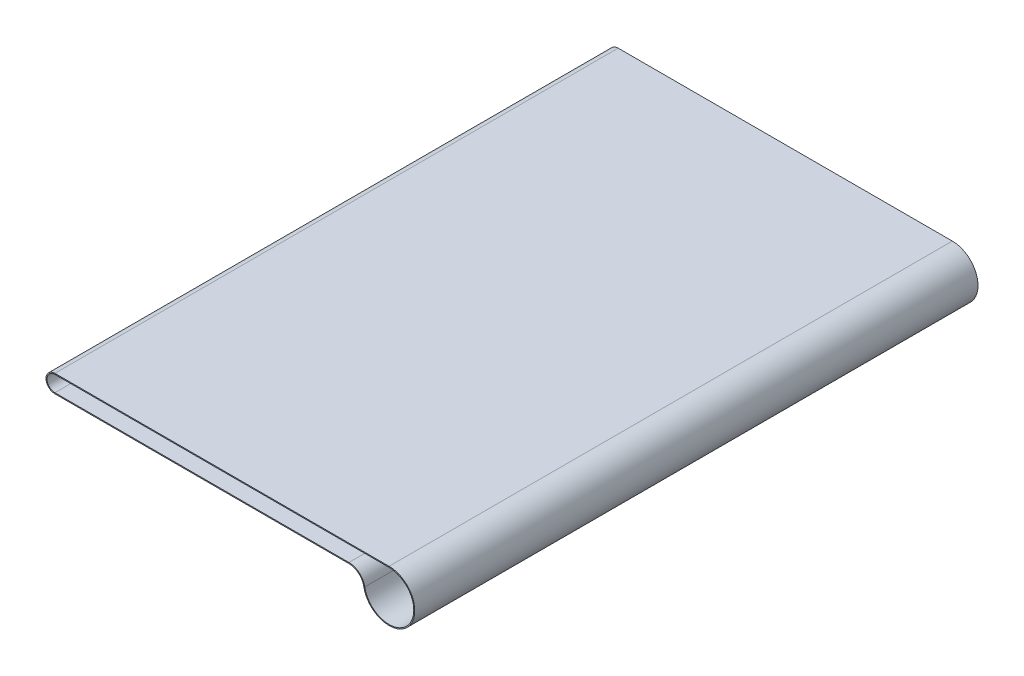
ISO-10303-21;
HEADER;
FILE_DESCRIPTION(('STEP AP214'),'2;1');
FILE_NAME('part.step','',(''),(''),'','','');
FILE_SCHEMA(('AUTOMOTIVE_DESIGN { 1 0 10303 214 1 1 1 1 }'));
ENDSEC;
DATA;
#1=APPLICATION_CONTEXT('core data for automotive mechanical design processes');
#2=APPLICATION_PROTOCOL_DEFINITION('international standard','automotive_design',2000,#1);
#3=PRODUCT_CONTEXT('',#1,'mechanical');
#4=PRODUCT('Part','Part','',(#3));
#5=PRODUCT_RELATED_PRODUCT_CATEGORY('part','',(#4));
#6=PRODUCT_DEFINITION_FORMATION('','',#4);
#7=PRODUCT_DEFINITION_CONTEXT('part definition',#1,'design');
#8=PRODUCT_DEFINITION('design','',#6,#7);
#9=PRODUCT_DEFINITION_SHAPE('','',#8);
#10=(LENGTH_UNIT() NAMED_UNIT(*) SI_UNIT(.MILLI.,.METRE.));
#11=(NAMED_UNIT(*) PLANE_ANGLE_UNIT() SI_UNIT($,.RADIAN.));
#12=(NAMED_UNIT(*) SI_UNIT($,.STERADIAN.) SOLID_ANGLE_UNIT());
#13=UNCERTAINTY_MEASURE_WITH_UNIT(LENGTH_MEASURE(1.E-05),#10,'distance_accuracy_value','');
#14=(GEOMETRIC_REPRESENTATION_CONTEXT(3) GLOBAL_UNCERTAINTY_ASSIGNED_CONTEXT((#13)) GLOBAL_UNIT_ASSIGNED_CONTEXT((#10,
#11,#12)) REPRESENTATION_CONTEXT('',''));
#15=CARTESIAN_POINT('',(0.,0.,0.));
#16=DIRECTION('',(0.,0.,1.));
#17=DIRECTION('',(1.,0.,0.));
#18=AXIS2_PLACEMENT_3D('',#15,#16,#17);
#19=CARTESIAN_POINT('',(285.123660002502,-32.2935750323031,570.));
#20=DIRECTION('',(0.,0.,1.));
#21=DIRECTION('',(1.,0.,0.));
#22=AXIS2_PLACEMENT_3D('',#19,#20,#21);
#23=PLANE('',#22);
#24=CARTESIAN_POINT('',(285.123660002502,-32.2935750323031,570.));
#25=DIRECTION('',(0.,0.,-1.));
#26=DIRECTION('',(1.,0.,0.));
#27=AXIS2_PLACEMENT_3D('',#24,#25,#26);
#28=CIRCLE('',#27,15.2935750323031);
#29=CARTESIAN_POINT('',(285.123660002502,-17.,570.));
#30=VERTEX_POINT('',#29);
#31=CARTESIAN_POINT('',(300.17678630454,-29.5923112903529,570.));
#32=VERTEX_POINT('',#31);
#33=EDGE_CURVE('E156',#30,#32,#28,.T.);
#34=ORIENTED_EDGE('',*,*,#33,.T.);
#35=CARTESIAN_POINT('',(325.768008960218,-25.,570.));
#36=DIRECTION('',(0.,0.,1.));
#37=DIRECTION('',(1.,0.,0.));
#38=AXIS2_PLACEMENT_3D('',#35,#36,#37);
#39=CIRCLE('',#38,26.);
#40=CARTESIAN_POINT('',(325.768008960218,0.999999999999997,570.));
#41=VERTEX_POINT('',#40);
#42=EDGE_CURVE('E159',#32,#41,#39,.T.);
#43=ORIENTED_EDGE('',*,*,#42,.T.);
#44=DIRECTION('',(-1.,0.,0.));
#45=VECTOR('',#44,1.);
#46=CARTESIAN_POINT('',(-12.4049645311594,0.999999999999999,570.));
#47=LINE('',#46,#45);
#48=CARTESIAN_POINT('',(-12.4049645311594,0.999999999999999,570.));
#49=VERTEX_POINT('',#48);
#50=EDGE_CURVE('E162',#41,#49,#47,.T.);
#51=ORIENTED_EDGE('',*,*,#50,.T.);
#52=CARTESIAN_POINT('',(-12.4049645311594,-8.,570.));
#53=DIRECTION('',(0.,0.,1.));
#54=DIRECTION('',(1.,0.,0.));
#55=AXIS2_PLACEMENT_3D('',#52,#53,#54);
#56=CIRCLE('',#55,9.);
#57=CARTESIAN_POINT('',(-12.4049645311594,-17.,570.));
#58=VERTEX_POINT('',#57);
#59=EDGE_CURVE('E164',#49,#58,#56,.T.);
#60=ORIENTED_EDGE('',*,*,#59,.T.);
#61=DIRECTION('',(1.,0.,0.));
#62=VECTOR('',#61,1.);
#63=CARTESIAN_POINT('',(-12.4049645311594,-17.,570.));
#64=LINE('',#63,#62);
#65=EDGE_CURVE('E166',#58,#30,#64,.T.);
#66=ORIENTED_EDGE('',*,*,#65,.T.);
#67=EDGE_LOOP('',(#34,#43,#51,#60,#66));
#68=FACE_BOUND('',#67,.T.);
#69=CARTESIAN_POINT('',(325.768008960218,-25.,570.));
#70=DIRECTION('',(0.,0.,1.));
#71=DIRECTION('',(1.,0.,0.));
#72=AXIS2_PLACEMENT_3D('',#69,#70,#71);
#73=CIRCLE('',#72,25.);
#74=CARTESIAN_POINT('',(301.161064098989,-29.4156839330317,570.));
#75=VERTEX_POINT('',#74);
#76=CARTESIAN_POINT('',(325.768008960218,0.,570.));
#77=VERTEX_POINT('',#76);
#78=EDGE_CURVE('E120',#75,#77,#73,.T.);
#79=ORIENTED_EDGE('',*,*,#78,.F.);
#80=CARTESIAN_POINT('',(285.123660002502,-32.2935750323031,570.));
#81=DIRECTION('',(0.,0.,-1.));
#82=DIRECTION('',(1.,0.,0.));
#83=AXIS2_PLACEMENT_3D('',#80,#81,#82);
#84=CIRCLE('',#83,16.2935750323031);
#85=CARTESIAN_POINT('',(285.123660002502,-16.,570.));
#86=VERTEX_POINT('',#85);
#87=EDGE_CURVE('E112',#86,#75,#84,.T.);
#88=ORIENTED_EDGE('',*,*,#87,.F.);
#89=DIRECTION('',(1.,0.,0.));
#90=VECTOR('',#89,1.);
#91=CARTESIAN_POINT('',(-12.4049645311594,-16.,570.));
#92=LINE('',#91,#90);
#93=CARTESIAN_POINT('',(-12.4049645311594,-16.,570.));
#94=VERTEX_POINT('',#93);
#95=EDGE_CURVE('E139',#94,#86,#92,.T.);
#96=ORIENTED_EDGE('',*,*,#95,.F.);
#97=CARTESIAN_POINT('',(-12.4049645311594,-8.,570.));
#98=DIRECTION('',(0.,0.,1.));
#99=DIRECTION('',(1.,0.,0.));
#100=AXIS2_PLACEMENT_3D('',#97,#98,#99);
#101=CIRCLE('',#100,8.);
#102=CARTESIAN_POINT('',(-12.4049645311594,0.,570.));
#103=VERTEX_POINT('',#102);
#104=EDGE_CURVE('E135',#103,#94,#101,.T.);
#105=ORIENTED_EDGE('',*,*,#104,.F.);
#106=DIRECTION('',(-1.,0.,0.));
#107=VECTOR('',#106,1.);
#108=CARTESIAN_POINT('',(-12.4049645311594,0.,570.));
#109=LINE('',#108,#107);
#110=EDGE_CURVE('E133',#77,#103,#109,.T.);
#111=ORIENTED_EDGE('',*,*,#110,.F.);
#112=EDGE_LOOP('',(#79,#88,#96,#105,#111));
#113=FACE_BOUND('',#112,.T.);
#114=ADVANCED_FACE('F35',(#68,#113),#23,.T.);
#115=CARTESIAN_POINT('',(285.123660002502,-32.2935750323031,0.));
#116=DIRECTION('',(0.,0.,1.));
#117=DIRECTION('',(1.,0.,0.));
#118=AXIS2_PLACEMENT_3D('',#115,#116,#117);
#119=PLANE('',#118);
#120=CARTESIAN_POINT('',(285.123660002502,-32.2935750323031,0.));
#121=DIRECTION('',(0.,0.,-1.));
#122=DIRECTION('',(1.,0.,0.));
#123=AXIS2_PLACEMENT_3D('',#120,#121,#122);
#124=CIRCLE('',#123,15.2935750323031);
#125=CARTESIAN_POINT('',(285.123660002502,-17.,0.));
#126=VERTEX_POINT('',#125);
#127=CARTESIAN_POINT('',(300.17678630454,-29.5923112903529,0.));
#128=VERTEX_POINT('',#127);
#129=EDGE_CURVE('E128',#126,#128,#124,.T.);
#130=ORIENTED_EDGE('',*,*,#129,.F.);
#131=DIRECTION('',(1.,0.,0.));
#132=VECTOR('',#131,1.);
#133=CARTESIAN_POINT('',(-12.4049645311594,-17.,0.));
#134=LINE('',#133,#132);
#135=CARTESIAN_POINT('',(-12.4049645311594,-17.,0.));
#136=VERTEX_POINT('',#135);
#137=EDGE_CURVE('E160',#136,#126,#134,.T.);
#138=ORIENTED_EDGE('',*,*,#137,.F.);
#139=CARTESIAN_POINT('',(-12.4049645311594,-8.,0.));
#140=DIRECTION('',(0.,0.,1.));
#141=DIRECTION('',(1.,0.,0.));
#142=AXIS2_PLACEMENT_3D('',#139,#140,#141);
#143=CIRCLE('',#142,9.);
#144=CARTESIAN_POINT('',(-12.4049645311594,0.999999999999999,0.));
#145=VERTEX_POINT('',#144);
#146=EDGE_CURVE('E175',#145,#136,#143,.T.);
#147=ORIENTED_EDGE('',*,*,#146,.F.);
#148=DIRECTION('',(-1.,0.,0.));
#149=VECTOR('',#148,1.);
#150=CARTESIAN_POINT('',(-12.4049645311594,0.999999999999999,0.));
#151=LINE('',#150,#149);
#152=CARTESIAN_POINT('',(325.768008960218,0.999999999999997,0.));
#153=VERTEX_POINT('',#152);
#154=EDGE_CURVE('E173',#153,#145,#151,.T.);
#155=ORIENTED_EDGE('',*,*,#154,.F.);
#156=CARTESIAN_POINT('',(325.768008960218,-25.,0.));
#157=DIRECTION('',(0.,0.,1.));
#158=DIRECTION('',(1.,0.,0.));
#159=AXIS2_PLACEMENT_3D('',#156,#157,#158);
#160=CIRCLE('',#159,26.);
#161=EDGE_CURVE('E171',#128,#153,#160,.T.);
#162=ORIENTED_EDGE('',*,*,#161,.F.);
#163=EDGE_LOOP('',(#130,#138,#147,#155,#162));
#164=FACE_BOUND('',#163,.T.);
#165=CARTESIAN_POINT('',(285.123660002502,-32.2935750323031,0.));
#166=DIRECTION('',(0.,0.,-1.));
#167=DIRECTION('',(1.,0.,0.));
#168=AXIS2_PLACEMENT_3D('',#165,#166,#167);
#169=CIRCLE('',#168,16.2935750323031);
#170=CARTESIAN_POINT('',(285.123660002502,-16.,0.));
#171=VERTEX_POINT('',#170);
#172=CARTESIAN_POINT('',(301.161064098989,-29.4156839330317,0.));
#173=VERTEX_POINT('',#172);
#174=EDGE_CURVE('E58',#171,#173,#169,.T.);
#175=ORIENTED_EDGE('',*,*,#174,.T.);
#176=CARTESIAN_POINT('',(325.768008960218,-25.,0.));
#177=DIRECTION('',(0.,0.,1.));
#178=DIRECTION('',(1.,0.,0.));
#179=AXIS2_PLACEMENT_3D('',#176,#177,#178);
#180=CIRCLE('',#179,25.);
#181=CARTESIAN_POINT('',(325.768008960218,0.,0.));
#182=VERTEX_POINT('',#181);
#183=EDGE_CURVE('E127',#173,#182,#180,.T.);
#184=ORIENTED_EDGE('',*,*,#183,.T.);
#185=DIRECTION('',(-1.,0.,0.));
#186=VECTOR('',#185,1.);
#187=CARTESIAN_POINT('',(-12.4049645311594,0.,0.));
#188=LINE('',#187,#186);
#189=CARTESIAN_POINT('',(-12.4049645311594,0.,0.));
#190=VERTEX_POINT('',#189);
#191=EDGE_CURVE('E143',#182,#190,#188,.T.);
#192=ORIENTED_EDGE('',*,*,#191,.T.);
#193=CARTESIAN_POINT('',(-12.4049645311594,-8.,0.));
#194=DIRECTION('',(0.,0.,1.));
#195=DIRECTION('',(1.,0.,0.));
#196=AXIS2_PLACEMENT_3D('',#193,#194,#195);
#197=CIRCLE('',#196,8.);
#198=CARTESIAN_POINT('',(-12.4049645311594,-16.,0.));
#199=VERTEX_POINT('',#198);
#200=EDGE_CURVE('E146',#190,#199,#197,.T.);
#201=ORIENTED_EDGE('',*,*,#200,.T.);
#202=DIRECTION('',(1.,0.,0.));
#203=VECTOR('',#202,1.);
#204=CARTESIAN_POINT('',(-12.4049645311594,-16.,0.));
#205=LINE('',#204,#203);
#206=EDGE_CURVE('E121',#199,#171,#205,.T.);
#207=ORIENTED_EDGE('',*,*,#206,.T.);
#208=EDGE_LOOP('',(#175,#184,#192,#201,#207));
#209=FACE_BOUND('',#208,.T.);
#210=ADVANCED_FACE('F196',(#164,#209),#119,.F.);
#211=CARTESIAN_POINT('',(285.123660002502,-32.2935750323031,570.));
#212=DIRECTION('',(0.,0.,-1.));
#213=DIRECTION('',(-1.,0.,0.));
#214=AXIS2_PLACEMENT_3D('',#211,#212,#213);
#215=CYLINDRICAL_SURFACE('',#214,15.2935750323031);
#216=ORIENTED_EDGE('',*,*,#129,.T.);
#217=DIRECTION('',(0.,0.,-1.));
#218=VECTOR('',#217,1.);
#219=CARTESIAN_POINT('',(300.17678630454,-29.5923112903529,570.));
#220=LINE('',#219,#218);
#221=EDGE_CURVE('E11',#32,#128,#220,.T.);
#222=ORIENTED_EDGE('',*,*,#221,.F.);
#223=ORIENTED_EDGE('',*,*,#33,.F.);
#224=DIRECTION('',(0.,0.,-1.));
#225=VECTOR('',#224,1.);
#226=CARTESIAN_POINT('',(285.123660002502,-17.,570.));
#227=LINE('',#226,#225);
#228=EDGE_CURVE('E168',#30,#126,#227,.T.);
#229=ORIENTED_EDGE('',*,*,#228,.T.);
#230=EDGE_LOOP('',(#216,#222,#223,#229));
#231=FACE_BOUND('',#230,.T.);
#232=ADVANCED_FACE('F37',(#231),#215,.F.);
#233=CARTESIAN_POINT('',(325.768008960218,-25.,570.));
#234=DIRECTION('',(0.,0.,-1.));
#235=DIRECTION('',(-1.,0.,0.));
#236=AXIS2_PLACEMENT_3D('',#233,#234,#235);
#237=CYLINDRICAL_SURFACE('',#236,26.);
#238=ORIENTED_EDGE('',*,*,#161,.T.);
#239=DIRECTION('',(0.,0.,-1.));
#240=VECTOR('',#239,1.);
#241=CARTESIAN_POINT('',(325.768008960218,0.999999999999997,570.));
#242=LINE('',#241,#240);
#243=EDGE_CURVE('E43',#41,#153,#242,.T.);
#244=ORIENTED_EDGE('',*,*,#243,.F.);
#245=ORIENTED_EDGE('',*,*,#42,.F.);
#246=ORIENTED_EDGE('',*,*,#221,.T.);
#247=EDGE_LOOP('',(#238,#244,#245,#246));
#248=FACE_BOUND('',#247,.T.);
#249=ADVANCED_FACE('F210',(#248),#237,.T.);
#250=CARTESIAN_POINT('',(-12.4049645311594,0.999999999999999,570.));
#251=DIRECTION('',(0.,-1.,0.));
#252=DIRECTION('',(1.,0.,0.));
#253=AXIS2_PLACEMENT_3D('',#250,#251,#252);
#254=PLANE('',#253);
#255=ORIENTED_EDGE('',*,*,#154,.T.);
#256=DIRECTION('',(0.,0.,-1.));
#257=VECTOR('',#256,1.);
#258=CARTESIAN_POINT('',(-12.4049645311594,0.999999999999999,570.));
#259=LINE('',#258,#257);
#260=EDGE_CURVE('E183',#49,#145,#259,.T.);
#261=ORIENTED_EDGE('',*,*,#260,.F.);
#262=ORIENTED_EDGE('',*,*,#50,.F.);
#263=ORIENTED_EDGE('',*,*,#243,.T.);
#264=EDGE_LOOP('',(#255,#261,#262,#263));
#265=FACE_BOUND('',#264,.T.);
#266=ADVANCED_FACE('F190',(#265),#254,.F.);
#267=CARTESIAN_POINT('',(-12.4049645311594,-8.,570.));
#268=DIRECTION('',(0.,0.,-1.));
#269=DIRECTION('',(-1.,0.,0.));
#270=AXIS2_PLACEMENT_3D('',#267,#268,#269);
#271=CYLINDRICAL_SURFACE('',#270,9.);
#272=ORIENTED_EDGE('',*,*,#146,.T.);
#273=DIRECTION('',(0.,0.,-1.));
#274=VECTOR('',#273,1.);
#275=CARTESIAN_POINT('',(-12.4049645311594,-17.,570.));
#276=LINE('',#275,#274);
#277=EDGE_CURVE('E180',#58,#136,#276,.T.);
#278=ORIENTED_EDGE('',*,*,#277,.F.);
#279=ORIENTED_EDGE('',*,*,#59,.F.);
#280=ORIENTED_EDGE('',*,*,#260,.T.);
#281=EDGE_LOOP('',(#272,#278,#279,#280));
#282=FACE_BOUND('',#281,.T.);
#283=ADVANCED_FACE('F201',(#282),#271,.T.);
#284=CARTESIAN_POINT('',(-12.4049645311594,-17.,570.));
#285=DIRECTION('',(0.,1.,0.));
#286=DIRECTION('',(0.,0.,1.));
#287=AXIS2_PLACEMENT_3D('',#284,#285,#286);
#288=PLANE('',#287);
#289=ORIENTED_EDGE('',*,*,#137,.T.);
#290=ORIENTED_EDGE('',*,*,#228,.F.);
#291=ORIENTED_EDGE('',*,*,#65,.F.);
#292=ORIENTED_EDGE('',*,*,#277,.T.);
#293=EDGE_LOOP('',(#289,#290,#291,#292));
#294=FACE_BOUND('',#293,.T.);
#295=ADVANCED_FACE('F205',(#294),#288,.F.);
#296=CARTESIAN_POINT('',(285.123660002502,-32.2935750323031,570.));
#297=DIRECTION('',(0.,0.,-1.));
#298=DIRECTION('',(-1.,0.,0.));
#299=AXIS2_PLACEMENT_3D('',#296,#297,#298);
#300=CYLINDRICAL_SURFACE('',#299,16.2935750323031);
#301=ORIENTED_EDGE('',*,*,#174,.F.);
#302=DIRECTION('',(0.,0.,-1.));
#303=VECTOR('',#302,1.);
#304=CARTESIAN_POINT('',(285.123660002502,-16.,570.));
#305=LINE('',#304,#303);
#306=EDGE_CURVE('E116',#86,#171,#305,.T.);
#307=ORIENTED_EDGE('',*,*,#306,.F.);
#308=ORIENTED_EDGE('',*,*,#87,.T.);
#309=DIRECTION('',(0.,0.,-1.));
#310=VECTOR('',#309,1.);
#311=CARTESIAN_POINT('',(301.161064098989,-29.4156839330317,570.));
#312=LINE('',#311,#310);
#313=EDGE_CURVE('E115',#75,#173,#312,.T.);
#314=ORIENTED_EDGE('',*,*,#313,.T.);
#315=EDGE_LOOP('',(#301,#307,#308,#314));
#316=FACE_BOUND('',#315,.T.);
#317=ADVANCED_FACE('F114',(#316),#300,.T.);
#318=CARTESIAN_POINT('',(325.768008960218,-25.,570.));
#319=DIRECTION('',(0.,0.,-1.));
#320=DIRECTION('',(-1.,0.,0.));
#321=AXIS2_PLACEMENT_3D('',#318,#319,#320);
#322=CYLINDRICAL_SURFACE('',#321,25.);
#323=ORIENTED_EDGE('',*,*,#183,.F.);
#324=ORIENTED_EDGE('',*,*,#313,.F.);
#325=ORIENTED_EDGE('',*,*,#78,.T.);
#326=DIRECTION('',(0.,0.,-1.));
#327=VECTOR('',#326,1.);
#328=CARTESIAN_POINT('',(325.768008960218,0.,570.));
#329=LINE('',#328,#327);
#330=EDGE_CURVE('E129',#77,#182,#329,.T.);
#331=ORIENTED_EDGE('',*,*,#330,.T.);
#332=EDGE_LOOP('',(#323,#324,#325,#331));
#333=FACE_BOUND('',#332,.T.);
#334=ADVANCED_FACE('F124',(#333),#322,.F.);
#335=CARTESIAN_POINT('',(-12.4049645311594,0.,570.));
#336=DIRECTION('',(0.,-1.,0.));
#337=DIRECTION('',(0.,0.,-1.));
#338=AXIS2_PLACEMENT_3D('',#335,#336,#337);
#339=PLANE('',#338);
#340=ORIENTED_EDGE('',*,*,#191,.F.);
#341=ORIENTED_EDGE('',*,*,#330,.F.);
#342=ORIENTED_EDGE('',*,*,#110,.T.);
#343=DIRECTION('',(0.,0.,-1.));
#344=VECTOR('',#343,1.);
#345=CARTESIAN_POINT('',(-12.4049645311594,0.,570.));
#346=LINE('',#345,#344);
#347=EDGE_CURVE('E153',#103,#190,#346,.T.);
#348=ORIENTED_EDGE('',*,*,#347,.T.);
#349=EDGE_LOOP('',(#340,#341,#342,#348));
#350=FACE_BOUND('',#349,.T.);
#351=ADVANCED_FACE('F253',(#350),#339,.T.);
#352=CARTESIAN_POINT('',(-12.4049645311594,-8.,570.));
#353=DIRECTION('',(0.,0.,-1.));
#354=DIRECTION('',(-1.,0.,0.));
#355=AXIS2_PLACEMENT_3D('',#352,#353,#354);
#356=CYLINDRICAL_SURFACE('',#355,8.);
#357=ORIENTED_EDGE('',*,*,#200,.F.);
#358=ORIENTED_EDGE('',*,*,#347,.F.);
#359=ORIENTED_EDGE('',*,*,#104,.T.);
#360=DIRECTION('',(0.,0.,-1.));
#361=VECTOR('',#360,1.);
#362=CARTESIAN_POINT('',(-12.4049645311594,-16.,570.));
#363=LINE('',#362,#361);
#364=EDGE_CURVE('E50',#94,#199,#363,.T.);
#365=ORIENTED_EDGE('',*,*,#364,.T.);
#366=EDGE_LOOP('',(#357,#358,#359,#365));
#367=FACE_BOUND('',#366,.T.);
#368=ADVANCED_FACE('F259',(#367),#356,.F.);
#369=CARTESIAN_POINT('',(-12.4049645311594,-16.,570.));
#370=DIRECTION('',(0.,1.,0.));
#371=DIRECTION('',(0.,0.,1.));
#372=AXIS2_PLACEMENT_3D('',#369,#370,#371);
#373=PLANE('',#372);
#374=ORIENTED_EDGE('',*,*,#206,.F.);
#375=ORIENTED_EDGE('',*,*,#364,.F.);
#376=ORIENTED_EDGE('',*,*,#95,.T.);
#377=ORIENTED_EDGE('',*,*,#306,.T.);
#378=EDGE_LOOP('',(#374,#375,#376,#377));
#379=FACE_BOUND('',#378,.T.);
#380=ADVANCED_FACE('F267',(#379),#373,.T.);
#381=CLOSED_SHELL('',(#114,#210,#232,#249,#266,#283,#295,#317,#334,#351,#368,#380));
#382=MANIFOLD_SOLID_BREP('B2',#381);
#383=ADVANCED_BREP_SHAPE_REPRESENTATION('',(#18,#382),#14);
#384=SHAPE_DEFINITION_REPRESENTATION(#9,#383);
ENDSEC;
END-ISO-10303-21;
